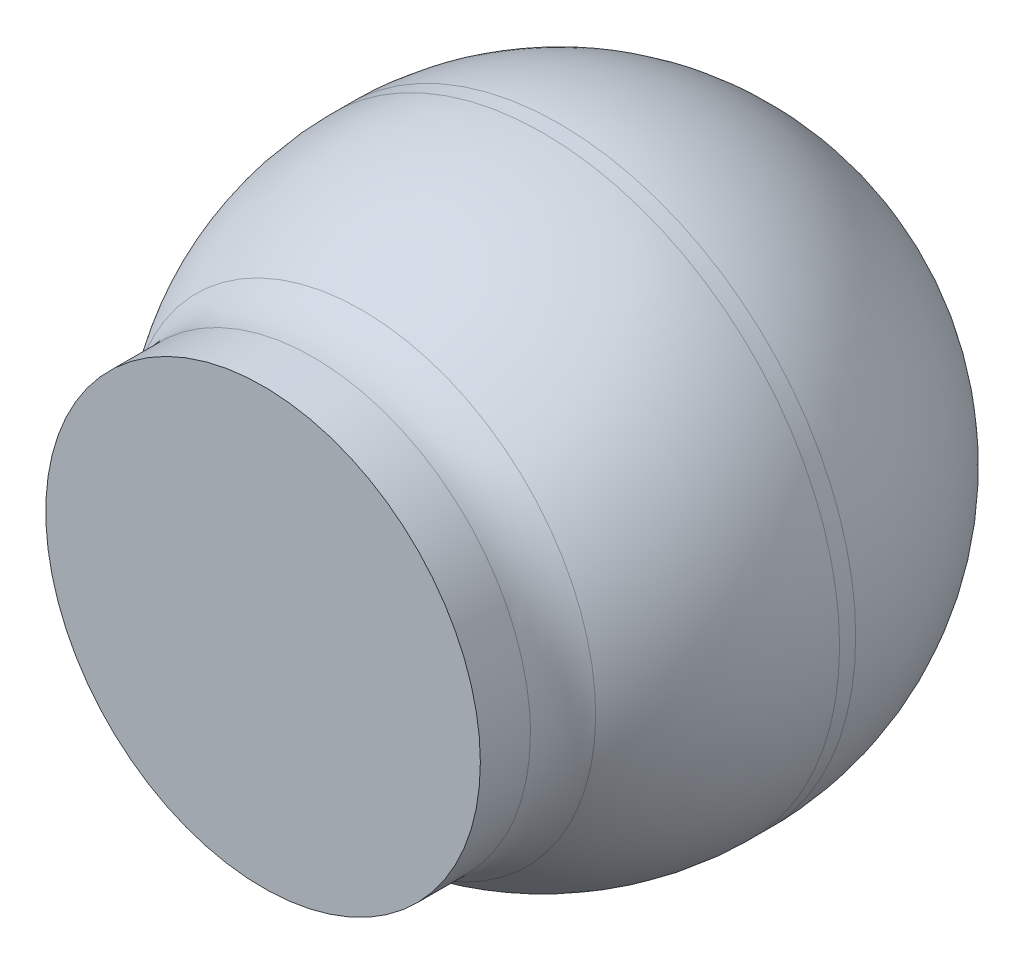
ISO-10303-21;
HEADER;
FILE_DESCRIPTION(('STEP AP214'),'2;1');
FILE_NAME('part.step','',(''),(''),'','','');
FILE_SCHEMA(('AUTOMOTIVE_DESIGN { 1 0 10303 214 1 1 1 1 }'));
ENDSEC;
DATA;
#1=APPLICATION_CONTEXT('core data for automotive mechanical design processes');
#2=APPLICATION_PROTOCOL_DEFINITION('international standard','automotive_design',2000,#1);
#3=PRODUCT_CONTEXT('',#1,'mechanical');
#4=PRODUCT('Part','Part','',(#3));
#5=PRODUCT_RELATED_PRODUCT_CATEGORY('part','',(#4));
#6=PRODUCT_DEFINITION_FORMATION('','',#4);
#7=PRODUCT_DEFINITION_CONTEXT('part definition',#1,'design');
#8=PRODUCT_DEFINITION('design','',#6,#7);
#9=PRODUCT_DEFINITION_SHAPE('','',#8);
#10=(LENGTH_UNIT() NAMED_UNIT(*) SI_UNIT(.MILLI.,.METRE.));
#11=(NAMED_UNIT(*) PLANE_ANGLE_UNIT() SI_UNIT($,.RADIAN.));
#12=(NAMED_UNIT(*) SI_UNIT($,.STERADIAN.) SOLID_ANGLE_UNIT());
#13=UNCERTAINTY_MEASURE_WITH_UNIT(LENGTH_MEASURE(1.E-05),#10,'distance_accuracy_value','');
#14=(GEOMETRIC_REPRESENTATION_CONTEXT(3) GLOBAL_UNCERTAINTY_ASSIGNED_CONTEXT((#13)) GLOBAL_UNIT_ASSIGNED_CONTEXT((#10,
#11,#12)) REPRESENTATION_CONTEXT('',''));
#15=CARTESIAN_POINT('',(0.,0.,0.));
#16=DIRECTION('',(0.,0.,1.));
#17=DIRECTION('',(1.,0.,0.));
#18=AXIS2_PLACEMENT_3D('',#15,#16,#17);
#19=CARTESIAN_POINT('',(-9.452919922269,-4.051349291452,10.006534503384));
#20=DIRECTION('',(0.,0.,-1.));
#21=DIRECTION('',(-1.,0.,0.));
#22=AXIS2_PLACEMENT_3D('',#19,#20,#21);
#23=PLANE('',#22);
#24=CARTESIAN_POINT('',(-9.452919922269,-4.051349291452,10.006534503384));
#25=DIRECTION('',(0.,0.,1.));
#26=DIRECTION('',(1.,0.,0.));
#27=AXIS2_PLACEMENT_3D('',#24,#25,#26);
#28=CIRCLE('',#27,0.275);
#29=CARTESIAN_POINT('',(-9.177919922269,-4.051349291452,10.006534503384));
#30=VERTEX_POINT('',#29);
#31=EDGE_CURVE('E20',#30,#30,#28,.F.);
#32=ORIENTED_EDGE('',*,*,#31,.F.);
#33=EDGE_LOOP('',(#32));
#34=FACE_BOUND('',#33,.T.);
#35=ADVANCED_FACE('F17',(#34),#23,.F.);
#36=CARTESIAN_POINT('',(-9.452919922269,-4.051349291452,9.906534503384));
#37=DIRECTION('',(0.,0.,1.));
#38=DIRECTION('',(1.,0.,0.));
#39=AXIS2_PLACEMENT_3D('',#36,#37,#38);
#40=CYLINDRICAL_SURFACE('',#39,0.275);
#41=CARTESIAN_POINT('',(-9.452919922269,-4.051349291452,9.943180457728));
#42=DIRECTION('',(0.,0.,-1.));
#43=DIRECTION('',(0.996700902337583,0.0811622527992436,0.));
#44=AXIS2_PLACEMENT_3D('',#41,#42,#43);
#45=CIRCLE('',#44,0.275000000000001);
#46=CARTESIAN_POINT('',(-9.17882717412617,-4.02902967193221,9.943180457728));
#47=VERTEX_POINT('',#46);
#48=EDGE_CURVE('E65',#47,#47,#45,.F.);
#49=ORIENTED_EDGE('',*,*,#48,.T.);
#50=EDGE_LOOP('',(#49));
#51=FACE_BOUND('',#50,.T.);
#52=ORIENTED_EDGE('',*,*,#31,.T.);
#53=EDGE_LOOP('',(#52));
#54=FACE_BOUND('',#53,.T.);
#55=ADVANCED_FACE('F62',(#51,#54),#40,.T.);
#56=CARTESIAN_POINT('',(-9.452919922269,-4.051349291452,9.943180457728));
#57=DIRECTION('',(0.,0.,-1.));
#58=DIRECTION('',(0.996700902337583,0.0811622527992448,0.));
#59=AXIS2_PLACEMENT_3D('',#56,#57,#58);
#60=TOROIDAL_SURFACE('',#59,0.375,0.1);
#61=ORIENTED_EDGE('',*,*,#48,.F.);
#62=EDGE_LOOP('',(#61));
#63=FACE_BOUND('',#62,.T.);
#64=CARTESIAN_POINT('',(-9.452919922269,-4.051349291452,9.881744931236));
#65=DIRECTION('',(0.,0.,-1.));
#66=DIRECTION('',(-0.996700902337598,-0.0811622527990598,0.));
#67=AXIS2_PLACEMENT_3D('',#64,#65,#66);
#68=CIRCLE('',#67,0.296097046412663);
#69=CARTESIAN_POINT('',(-9.748040115608,-4.075381194786,9.881744931236));
#70=VERTEX_POINT('',#69);
#71=EDGE_CURVE('E39',#70,#70,#68,.T.);
#72=ORIENTED_EDGE('',*,*,#71,.F.);
#73=EDGE_LOOP('',(#72));
#74=FACE_BOUND('',#73,.T.);
#75=ADVANCED_FACE('F57',(#63,#74),#60,.F.);
#76=CARTESIAN_POINT('',(-9.826682760645,-4.081785136252,9.651976062157));
#77=CARTESIAN_POINT('',(-9.826682760645,-4.081785136252,9.701461392103));
#78=CARTESIAN_POINT('',(-9.818526217348,-4.081120941579,9.750947004335));
#79=CARTESIAN_POINT('',(-9.802207085349,-4.079792059952,9.798626332798));
#80=CARTESIAN_POINT('',(-9.778341390838,-4.077848654938,9.842699544317));
#81=CARTESIAN_POINT('',(-9.748040115608,-4.075381194786,9.881744931236));
#82=(BOUNDED_CURVE() B_SPLINE_CURVE(5,(#76,#77,#78,#79,#80,#81),.UNSPECIFIED.,.F.,
.F.) B_SPLINE_CURVE_WITH_KNOTS((6,6),(0.,0.661568582165),
.UNSPECIFIED.) CURVE() GEOMETRIC_REPRESENTATION_ITEM() RATIONAL_B_SPLINE_CURVE((1.,1.,1.,1.,1.,1.)) REPRESENTATION_ITEM(''));
#83=CARTESIAN_POINT('',(-9.452919922269,-4.051349291452,9.651976062157));
#84=DIRECTION('',(0.,0.,-1.));
#85=AXIS1_PLACEMENT('',#83,#84);
#86=SURFACE_OF_REVOLUTION('',#82,#85);
#87=CARTESIAN_POINT('',(-9.452919922269,-4.051349291452,9.651976062157));
#88=DIRECTION('',(0.,0.,1.));
#89=DIRECTION('',(1.,0.,0.));
#90=AXIS2_PLACEMENT_3D('',#87,#88,#89);
#91=CIRCLE('',#90,0.375);
#92=CARTESIAN_POINT('',(-9.077919922269,-4.051349291452,9.651976062157));
#93=VERTEX_POINT('',#92);
#94=EDGE_CURVE('E36',#93,#93,#91,.F.);
#95=ORIENTED_EDGE('',*,*,#94,.F.);
#96=EDGE_LOOP('',(#95));
#97=FACE_BOUND('',#96,.T.);
#98=ORIENTED_EDGE('',*,*,#71,.T.);
#99=EDGE_LOOP('',(#98));
#100=FACE_BOUND('',#99,.T.);
#101=ADVANCED_FACE('F53',(#97,#100),#86,.F.);
#102=CARTESIAN_POINT('',(-9.452919922269,-4.051349291452,9.256534503384));
#103=DIRECTION('',(0.,0.,1.));
#104=DIRECTION('',(1.,0.,0.));
#105=AXIS2_PLACEMENT_3D('',#102,#103,#104);
#106=CYLINDRICAL_SURFACE('',#105,0.375);
#107=CARTESIAN_POINT('',(-9.452919922269,-4.051349291452,9.631534503384));
#108=DIRECTION('',(0.,0.,-1.));
#109=DIRECTION('',(0.0811622527992357,-0.996700902337583,0.));
#110=AXIS2_PLACEMENT_3D('',#107,#108,#109);
#111=CIRCLE('',#110,0.375);
#112=CARTESIAN_POINT('',(-9.42248407746929,-4.42511212982859,9.631534503384));
#113=VERTEX_POINT('',#112);
#114=CARTESIAN_POINT('',(-9.48335576706871,-3.67758645307541,9.631534503384));
#115=VERTEX_POINT('',#114);
#116=EDGE_CURVE('E11',#113,#115,#111,.T.);
#117=ORIENTED_EDGE('',*,*,#116,.F.);
#118=CARTESIAN_POINT('',(-9.452919922269,-4.051349291452,9.631534503384));
#119=DIRECTION('',(0.,0.,1.));
#120=DIRECTION('',(0.0811622527992365,-0.996700902337583,0.));
#121=AXIS2_PLACEMENT_3D('',#118,#119,#120);
#122=CIRCLE('',#121,0.375);
#123=EDGE_CURVE('E25',#115,#113,#122,.F.);
#124=ORIENTED_EDGE('',*,*,#123,.F.);
#125=EDGE_LOOP('',(#117,#124));
#126=FACE_BOUND('',#125,.T.);
#127=ORIENTED_EDGE('',*,*,#94,.T.);
#128=EDGE_LOOP('',(#127));
#129=FACE_BOUND('',#128,.T.);
#130=ADVANCED_FACE('F34',(#126,#129),#106,.T.);
#131=CARTESIAN_POINT('',(-9.452919922269,-4.051349291452,9.631534503384));
#132=DIRECTION('',(0.0811622527992361,-0.996700902337583,0.));
#133=DIRECTION('',(-0.996700902337583,-0.0811622527992361,0.));
#134=AXIS2_PLACEMENT_3D('',#131,#132,#133);
#135=SPHERICAL_SURFACE('',#134,0.375);
#136=ORIENTED_EDGE('',*,*,#123,.T.);
#137=ORIENTED_EDGE('',*,*,#116,.T.);
#138=EDGE_LOOP('',(#136,#137));
#139=FACE_BOUND('',#138,.T.);
#140=ADVANCED_FACE('F32',(#139),#135,.T.);
#141=CLOSED_SHELL('',(#35,#55,#75,#101,#130,#140));
#142=MANIFOLD_SOLID_BREP('B1',#141);
#143=ADVANCED_BREP_SHAPE_REPRESENTATION('',(#18,#142),#14);
#144=SHAPE_DEFINITION_REPRESENTATION(#9,#143);
ENDSEC;
END-ISO-10303-21;
